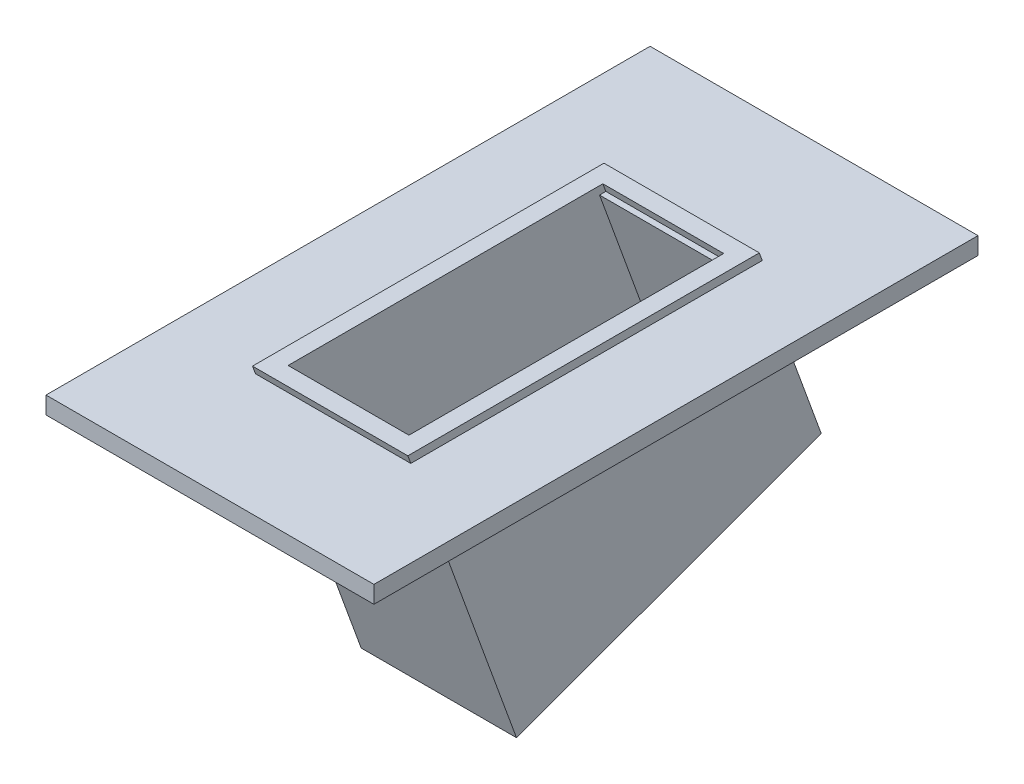
ISO-10303-21;
HEADER;
FILE_DESCRIPTION(('STEP AP214'),'2;1');
FILE_NAME('part.step','',(''),(''),'','','');
FILE_SCHEMA(('AUTOMOTIVE_DESIGN { 1 0 10303 214 1 1 1 1 }'));
ENDSEC;
DATA;
#1=APPLICATION_CONTEXT('core data for automotive mechanical design processes');
#2=APPLICATION_PROTOCOL_DEFINITION('international standard','automotive_design',2000,#1);
#3=PRODUCT_CONTEXT('',#1,'mechanical');
#4=PRODUCT('Part','Part','',(#3));
#5=PRODUCT_RELATED_PRODUCT_CATEGORY('part','',(#4));
#6=PRODUCT_DEFINITION_FORMATION('','',#4);
#7=PRODUCT_DEFINITION_CONTEXT('part definition',#1,'design');
#8=PRODUCT_DEFINITION('design','',#6,#7);
#9=PRODUCT_DEFINITION_SHAPE('','',#8);
#10=(LENGTH_UNIT() NAMED_UNIT(*) SI_UNIT(.MILLI.,.METRE.));
#11=(NAMED_UNIT(*) PLANE_ANGLE_UNIT() SI_UNIT($,.RADIAN.));
#12=(NAMED_UNIT(*) SI_UNIT($,.STERADIAN.) SOLID_ANGLE_UNIT());
#13=UNCERTAINTY_MEASURE_WITH_UNIT(LENGTH_MEASURE(1.E-05),#10,'distance_accuracy_value','');
#14=(GEOMETRIC_REPRESENTATION_CONTEXT(3) GLOBAL_UNCERTAINTY_ASSIGNED_CONTEXT((#13)) GLOBAL_UNIT_ASSIGNED_CONTEXT((#10,
#11,#12)) REPRESENTATION_CONTEXT('',''));
#15=CARTESIAN_POINT('',(0.,0.,0.));
#16=DIRECTION('',(0.,0.,1.));
#17=DIRECTION('',(1.,0.,0.));
#18=AXIS2_PLACEMENT_3D('',#15,#16,#17);
#19=CARTESIAN_POINT('',(18.,0.,0.));
#20=DIRECTION('',(-1.,0.,0.));
#21=DIRECTION('',(0.,0.,1.));
#22=AXIS2_PLACEMENT_3D('',#19,#20,#21);
#23=PLANE('',#22);
#24=DIRECTION('',(0.,0.,1.));
#25=VECTOR('',#24,1.);
#26=CARTESIAN_POINT('',(18.,0.,55.));
#27=LINE('',#26,#25);
#28=CARTESIAN_POINT('',(18.,0.,0.));
#29=VERTEX_POINT('',#28);
#30=CARTESIAN_POINT('',(18.,0.,40.7279404685324));
#31=VERTEX_POINT('',#30);
#32=EDGE_CURVE('E12',#29,#31,#27,.T.);
#33=ORIENTED_EDGE('',*,*,#32,.F.);
#34=DIRECTION('',(0.,0.939692620785908,0.342020143325669));
#35=VECTOR('',#34,1.);
#36=CARTESIAN_POINT('',(18.,0.,0.));
#37=LINE('',#36,#35);
#38=CARTESIAN_POINT('',(18.,0.939692620785908,0.34202014332567));
#39=VERTEX_POINT('',#38);
#40=EDGE_CURVE('E373',#29,#39,#37,.T.);
#41=ORIENTED_EDGE('',*,*,#40,.T.);
#42=DIRECTION('',(0.,0.,1.));
#43=VECTOR('',#42,1.);
#44=CARTESIAN_POINT('',(18.,0.939692620785908,0.34202014332567));
#45=LINE('',#44,#43);
#46=CARTESIAN_POINT('',(18.,0.939692620785908,41.0699606118581));
#47=VERTEX_POINT('',#46);
#48=EDGE_CURVE('E394',#39,#47,#45,.T.);
#49=ORIENTED_EDGE('',*,*,#48,.T.);
#50=DIRECTION('',(0.,0.939692620785908,0.342020143325669));
#51=VECTOR('',#50,1.);
#52=CARTESIAN_POINT('',(18.,0.,40.7279404685324));
#53=LINE('',#52,#51);
#54=EDGE_CURVE('E385',#31,#47,#53,.T.);
#55=ORIENTED_EDGE('',*,*,#54,.F.);
#56=EDGE_LOOP('',(#33,#41,#49,#55));
#57=FACE_BOUND('',#56,.T.);
#58=ADVANCED_FACE('F35',(#57),#23,.F.);
#59=DIRECTION('',(0.,0.,-1.));
#60=VECTOR('',#59,1.);
#61=CARTESIAN_POINT('',(18.,-2.,55.));
#62=LINE('',#61,#60);
#63=CARTESIAN_POINT('',(18.,-2.,40.));
#64=VERTEX_POINT('',#63);
#65=CARTESIAN_POINT('',(18.,-2.,0.));
#66=VERTEX_POINT('',#65);
#67=EDGE_CURVE('E44',#64,#66,#62,.T.);
#68=ORIENTED_EDGE('',*,*,#67,.F.);
#69=DIRECTION('',(0.,-0.939692620785908,-0.34202014332567));
#70=VECTOR('',#69,1.);
#71=CARTESIAN_POINT('',(18.,-14.8557521937308,35.3208888623795));
#72=LINE('',#71,#70);
#73=CARTESIAN_POINT('',(18.,-33.649604609449,28.4804859958661));
#74=VERTEX_POINT('',#73);
#75=EDGE_CURVE('E234',#64,#74,#72,.T.);
#76=ORIENTED_EDGE('',*,*,#75,.T.);
#77=DIRECTION('',(0.,0.342020143325669,-0.939692620785908));
#78=VECTOR('',#77,1.);
#79=CARTESIAN_POINT('',(18.,-33.649604609449,28.4804859958661));
#80=LINE('',#79,#78);
#81=CARTESIAN_POINT('',(18.,-20.7938524157182,-6.84040286651339));
#82=VERTEX_POINT('',#81);
#83=EDGE_CURVE('E232',#74,#82,#80,.T.);
#84=ORIENTED_EDGE('',*,*,#83,.T.);
#85=DIRECTION('',(0.,0.939692620785908,0.342020143325669));
#86=VECTOR('',#85,1.);
#87=CARTESIAN_POINT('',(18.,-2.,0.));
#88=LINE('',#87,#86);
#89=EDGE_CURVE('E229',#82,#66,#88,.T.);
#90=ORIENTED_EDGE('',*,*,#89,.T.);
#91=EDGE_LOOP('',(#68,#76,#84,#90));
#92=FACE_BOUND('',#91,.T.);
#93=ADVANCED_FACE('F440',(#92),#23,.F.);
#94=CARTESIAN_POINT('',(0.,0.,0.));
#95=DIRECTION('',(-1.,0.,0.));
#96=DIRECTION('',(0.,0.,1.));
#97=AXIS2_PLACEMENT_3D('',#94,#95,#96);
#98=PLANE('',#97);
#99=DIRECTION('',(0.,0.,-1.));
#100=VECTOR('',#99,1.);
#101=CARTESIAN_POINT('',(0.,0.,-15.));
#102=LINE('',#101,#100);
#103=CARTESIAN_POINT('',(0.,0.,40.7279404685324));
#104=VERTEX_POINT('',#103);
#105=CARTESIAN_POINT('',(0.,0.,0.));
#106=VERTEX_POINT('',#105);
#107=EDGE_CURVE('E228',#104,#106,#102,.T.);
#108=ORIENTED_EDGE('',*,*,#107,.F.);
#109=DIRECTION('',(0.,0.939692620785908,0.342020143325669));
#110=VECTOR('',#109,1.);
#111=CARTESIAN_POINT('',(0.,0.,40.7279404685324));
#112=LINE('',#111,#110);
#113=CARTESIAN_POINT('',(0.,0.939692620785908,41.0699606118581));
#114=VERTEX_POINT('',#113);
#115=EDGE_CURVE('E404',#104,#114,#112,.T.);
#116=ORIENTED_EDGE('',*,*,#115,.T.);
#117=DIRECTION('',(0.,0.,-1.));
#118=VECTOR('',#117,1.);
#119=CARTESIAN_POINT('',(0.,0.939692620785908,0.342020143325669));
#120=LINE('',#119,#118);
#121=CARTESIAN_POINT('',(0.,0.939692620785908,0.342020143325669));
#122=VERTEX_POINT('',#121);
#123=EDGE_CURVE('E376',#114,#122,#120,.T.);
#124=ORIENTED_EDGE('',*,*,#123,.T.);
#125=DIRECTION('',(0.,0.939692620785908,0.342020143325669));
#126=VECTOR('',#125,1.);
#127=CARTESIAN_POINT('',(0.,0.,0.));
#128=LINE('',#127,#126);
#129=EDGE_CURVE('E382',#106,#122,#128,.T.);
#130=ORIENTED_EDGE('',*,*,#129,.F.);
#131=EDGE_LOOP('',(#108,#116,#124,#130));
#132=FACE_BOUND('',#131,.T.);
#133=ADVANCED_FACE('F438',(#132),#98,.T.);
#134=CARTESIAN_POINT('',(0.,0.939692620785908,0.342020143325669));
#135=DIRECTION('',(0.,1.,0.));
#136=DIRECTION('',(0.,0.,1.));
#137=AXIS2_PLACEMENT_3D('',#134,#135,#136);
#138=PLANE('',#137);
#139=ORIENTED_EDGE('',*,*,#48,.F.);
#140=DIRECTION('',(1.,0.,0.));
#141=VECTOR('',#140,1.);
#142=CARTESIAN_POINT('',(0.,0.939692620785908,0.342020143325669));
#143=LINE('',#142,#141);
#144=EDGE_CURVE('E372',#122,#39,#143,.T.);
#145=ORIENTED_EDGE('',*,*,#144,.F.);
#146=ORIENTED_EDGE('',*,*,#123,.F.);
#147=DIRECTION('',(-1.,0.,0.));
#148=VECTOR('',#147,1.);
#149=CARTESIAN_POINT('',(0.,0.939692620785908,41.0699606118581));
#150=LINE('',#149,#148);
#151=EDGE_CURVE('E389',#47,#114,#150,.T.);
#152=ORIENTED_EDGE('',*,*,#151,.F.);
#153=EDGE_LOOP('',(#139,#145,#146,#152));
#154=FACE_BOUND('',#153,.T.);
#155=DIRECTION('',(1.,0.,0.));
#156=VECTOR('',#155,1.);
#157=CARTESIAN_POINT('',(0.,0.939692620785908,2.47037568827749));
#158=LINE('',#157,#156);
#159=CARTESIAN_POINT('',(2.,0.939692620785908,2.47037568827749));
#160=VERTEX_POINT('',#159);
#161=CARTESIAN_POINT('',(16.,0.939692620785908,2.4703756882775));
#162=VERTEX_POINT('',#161);
#163=EDGE_CURVE('E322',#160,#162,#158,.T.);
#164=ORIENTED_EDGE('',*,*,#163,.T.);
#165=DIRECTION('',(0.,0.,1.));
#166=VECTOR('',#165,1.);
#167=CARTESIAN_POINT('',(16.,0.939692620785908,0.342020143325669));
#168=LINE('',#167,#166);
#169=CARTESIAN_POINT('',(16.,0.939692620785908,38.9416050669062));
#170=VERTEX_POINT('',#169);
#171=EDGE_CURVE('E330',#162,#170,#168,.T.);
#172=ORIENTED_EDGE('',*,*,#171,.T.);
#173=DIRECTION('',(-1.,0.,0.));
#174=VECTOR('',#173,1.);
#175=CARTESIAN_POINT('',(0.,0.939692620785908,38.9416050669062));
#176=LINE('',#175,#174);
#177=CARTESIAN_POINT('',(2.,0.939692620785908,38.9416050669062));
#178=VERTEX_POINT('',#177);
#179=EDGE_CURVE('E364',#170,#178,#176,.T.);
#180=ORIENTED_EDGE('',*,*,#179,.T.);
#181=DIRECTION('',(0.,0.,-1.));
#182=VECTOR('',#181,1.);
#183=CARTESIAN_POINT('',(2.,0.939692620785908,0.));
#184=LINE('',#183,#182);
#185=EDGE_CURVE('E359',#178,#160,#184,.T.);
#186=ORIENTED_EDGE('',*,*,#185,.T.);
#187=EDGE_LOOP('',(#164,#172,#180,#186));
#188=FACE_BOUND('',#187,.T.);
#189=ADVANCED_FACE('F427',(#154,#188),#138,.T.);
#190=CARTESIAN_POINT('',(18.,-2.,55.));
#191=DIRECTION('',(0.,0.,-1.));
#192=DIRECTION('',(-1.,0.,0.));
#193=AXIS2_PLACEMENT_3D('',#190,#191,#192);
#194=PLANE('',#193);
#195=DIRECTION('',(-1.,0.,0.));
#196=VECTOR('',#195,1.);
#197=CARTESIAN_POINT('',(18.,0.,55.));
#198=LINE('',#197,#196);
#199=CARTESIAN_POINT('',(28.,0.,55.));
#200=VERTEX_POINT('',#199);
#201=CARTESIAN_POINT('',(-10.,0.,55.));
#202=VERTEX_POINT('',#201);
#203=EDGE_CURVE('E196',#200,#202,#198,.T.);
#204=ORIENTED_EDGE('',*,*,#203,.T.);
#205=DIRECTION('',(0.,1.,0.));
#206=VECTOR('',#205,1.);
#207=CARTESIAN_POINT('',(-10.,0.,55.));
#208=LINE('',#207,#206);
#209=CARTESIAN_POINT('',(-10.,-2.,55.));
#210=VERTEX_POINT('',#209);
#211=EDGE_CURVE('E192',#210,#202,#208,.T.);
#212=ORIENTED_EDGE('',*,*,#211,.F.);
#213=DIRECTION('',(-1.,0.,0.));
#214=VECTOR('',#213,1.);
#215=CARTESIAN_POINT('',(18.,-2.,55.));
#216=LINE('',#215,#214);
#217=CARTESIAN_POINT('',(28.,-2.,55.));
#218=VERTEX_POINT('',#217);
#219=EDGE_CURVE('E187',#218,#210,#216,.T.);
#220=ORIENTED_EDGE('',*,*,#219,.F.);
#221=DIRECTION('',(0.,-1.,0.));
#222=VECTOR('',#221,1.);
#223=CARTESIAN_POINT('',(28.,-2.,55.));
#224=LINE('',#223,#222);
#225=EDGE_CURVE('E190',#200,#218,#224,.T.);
#226=ORIENTED_EDGE('',*,*,#225,.F.);
#227=EDGE_LOOP('',(#204,#212,#220,#226));
#228=FACE_BOUND('',#227,.T.);
#229=ADVANCED_FACE('F37',(#228),#194,.F.);
#230=CARTESIAN_POINT('',(18.,-14.8557521937308,35.3208888623795));
#231=DIRECTION('',(0.,0.34202014332567,-0.939692620785908));
#232=DIRECTION('',(0.,0.939692620785908,0.34202014332567));
#233=AXIS2_PLACEMENT_3D('',#230,#231,#232);
#234=PLANE('',#233);
#235=DIRECTION('',(0.,-0.939692620785908,-0.34202014332567));
#236=VECTOR('',#235,1.);
#237=CARTESIAN_POINT('',(0.,-14.8557521937308,35.3208888623795));
#238=LINE('',#237,#236);
#239=CARTESIAN_POINT('',(0.,-2.,40.));
#240=VERTEX_POINT('',#239);
#241=CARTESIAN_POINT('',(0.,-33.649604609449,28.4804859958661));
#242=VERTEX_POINT('',#241);
#243=EDGE_CURVE('E248',#240,#242,#238,.T.);
#244=ORIENTED_EDGE('',*,*,#243,.T.);
#245=DIRECTION('',(-1.,0.,0.));
#246=VECTOR('',#245,1.);
#247=CARTESIAN_POINT('',(18.,-33.649604609449,28.4804859958661));
#248=LINE('',#247,#246);
#249=EDGE_CURVE('E258',#74,#242,#248,.T.);
#250=ORIENTED_EDGE('',*,*,#249,.F.);
#251=ORIENTED_EDGE('',*,*,#75,.F.);
#252=DIRECTION('',(-1.,0.,0.));
#253=VECTOR('',#252,1.);
#254=CARTESIAN_POINT('',(18.,-2.,40.));
#255=LINE('',#254,#253);
#256=EDGE_CURVE('E197',#64,#240,#255,.T.);
#257=ORIENTED_EDGE('',*,*,#256,.T.);
#258=EDGE_LOOP('',(#244,#250,#251,#257));
#259=FACE_BOUND('',#258,.T.);
#260=ADVANCED_FACE('F635',(#259),#234,.F.);
#261=CARTESIAN_POINT('',(18.,-33.649604609449,28.4804859958661));
#262=DIRECTION('',(0.,0.939692620785908,0.342020143325669));
#263=DIRECTION('',(0.,-0.342020143325669,0.939692620785908));
#264=AXIS2_PLACEMENT_3D('',#261,#262,#263);
#265=PLANE('',#264);
#266=CARTESIAN_POINT('',(6.49999999999999,-22.5018505346893,-2.14771660216916));
#267=DIRECTION('',(0.,-0.939692620785908,-0.342020143325669));
#268=DIRECTION('',(0.,-0.342020143325669,0.939692620785908));
#269=AXIS2_PLACEMENT_3D('',#266,#267,#268);
#270=CIRCLE('',#269,1.);
#271=CARTESIAN_POINT('',(6.49999999999999,-22.843870678015,-1.20802398138325));
#272=VERTEX_POINT('',#271);
#273=EDGE_CURVE('E292',#272,#272,#270,.T.);
#274=ORIENTED_EDGE('',*,*,#273,.F.);
#275=EDGE_LOOP('',(#274));
#276=FACE_BOUND('',#275,.T.);
#277=CARTESIAN_POINT('',(11.5,-22.5018505346893,-2.14771660216916));
#278=DIRECTION('',(0.,-0.939692620785908,-0.342020143325669));
#279=DIRECTION('',(0.,0.342020143325669,-0.939692620785908));
#280=AXIS2_PLACEMENT_3D('',#277,#278,#279);
#281=CIRCLE('',#280,0.999999999999998);
#282=CARTESIAN_POINT('',(11.5,-22.1598303913637,-3.08740922295507));
#283=VERTEX_POINT('',#282);
#284=EDGE_CURVE('E288',#283,#283,#281,.T.);
#285=ORIENTED_EDGE('',*,*,#284,.F.);
#286=EDGE_LOOP('',(#285));
#287=FACE_BOUND('',#286,.T.);
#288=CARTESIAN_POINT('',(11.5,-31.9416064904778,23.7877997315219));
#289=DIRECTION('',(0.,-0.939692620785908,-0.342020143325669));
#290=DIRECTION('',(0.,-0.342020143325669,0.939692620785908));
#291=AXIS2_PLACEMENT_3D('',#288,#289,#290);
#292=CIRCLE('',#291,0.999999999999999);
#293=CARTESIAN_POINT('',(11.5,-32.2836266338035,24.7274923523078));
#294=VERTEX_POINT('',#293);
#295=EDGE_CURVE('E284',#294,#294,#292,.T.);
#296=ORIENTED_EDGE('',*,*,#295,.F.);
#297=EDGE_LOOP('',(#296));
#298=FACE_BOUND('',#297,.T.);
#299=CARTESIAN_POINT('',(6.49999999999999,-31.9416064904778,23.7877997315219));
#300=DIRECTION('',(0.,-0.939692620785908,-0.342020143325669));
#301=DIRECTION('',(0.,0.342020143325669,-0.939692620785908));
#302=AXIS2_PLACEMENT_3D('',#299,#300,#301);
#303=CIRCLE('',#302,1.);
#304=CARTESIAN_POINT('',(6.49999999999999,-31.5995863471522,22.848107110736));
#305=VERTEX_POINT('',#304);
#306=EDGE_CURVE('E280',#305,#305,#303,.T.);
#307=ORIENTED_EDGE('',*,*,#306,.F.);
#308=EDGE_LOOP('',(#307));
#309=FACE_BOUND('',#308,.T.);
#310=DIRECTION('',(1.,0.,0.));
#311=VECTOR('',#310,1.);
#312=CARTESIAN_POINT('',(3.5,-23.2884968643384,0.0135764256384303));
#313=LINE('',#312,#311);
#314=CARTESIAN_POINT('',(3.5,-23.2884968643384,0.0135764256384355));
#315=VERTEX_POINT('',#314);
#316=CARTESIAN_POINT('',(14.5,-23.2884968643384,0.0135764256384303));
#317=VERTEX_POINT('',#316);
#318=EDGE_CURVE('E311',#315,#317,#313,.T.);
#319=ORIENTED_EDGE('',*,*,#318,.F.);
#320=DIRECTION('',(0.,0.342020143325669,-0.939692620785908));
#321=VECTOR('',#320,1.);
#322=CARTESIAN_POINT('',(3.5,-31.1549601608288,21.6265067037143));
#323=LINE('',#322,#321);
#324=CARTESIAN_POINT('',(3.5,-31.1549601608288,21.6265067037143));
#325=VERTEX_POINT('',#324);
#326=EDGE_CURVE('E52',#325,#315,#323,.T.);
#327=ORIENTED_EDGE('',*,*,#326,.F.);
#328=DIRECTION('',(-1.,0.,0.));
#329=VECTOR('',#328,1.);
#330=CARTESIAN_POINT('',(3.5,-31.1549601608288,21.6265067037143));
#331=LINE('',#330,#329);
#332=CARTESIAN_POINT('',(14.5,-31.1549601608288,21.6265067037143));
#333=VERTEX_POINT('',#332);
#334=EDGE_CURVE('E316',#333,#325,#331,.T.);
#335=ORIENTED_EDGE('',*,*,#334,.F.);
#336=DIRECTION('',(0.,-0.342020143325669,0.939692620785908));
#337=VECTOR('',#336,1.);
#338=CARTESIAN_POINT('',(14.5,-31.1549601608288,21.6265067037143));
#339=LINE('',#338,#337);
#340=EDGE_CURVE('E313',#317,#333,#339,.T.);
#341=ORIENTED_EDGE('',*,*,#340,.F.);
#342=EDGE_LOOP('',(#319,#327,#335,#341));
#343=FACE_BOUND('',#342,.T.);
#344=DIRECTION('',(0.,0.342020143325669,-0.939692620785908));
#345=VECTOR('',#344,1.);
#346=CARTESIAN_POINT('',(0.,-33.649604609449,28.4804859958661));
#347=LINE('',#346,#345);
#348=CARTESIAN_POINT('',(0.,-20.7938524157182,-6.84040286651339));
#349=VERTEX_POINT('',#348);
#350=EDGE_CURVE('E241',#242,#349,#347,.T.);
#351=ORIENTED_EDGE('',*,*,#350,.T.);
#352=DIRECTION('',(-1.,0.,0.));
#353=VECTOR('',#352,1.);
#354=CARTESIAN_POINT('',(18.,-20.7938524157182,-6.84040286651339));
#355=LINE('',#354,#353);
#356=EDGE_CURVE('E256',#82,#349,#355,.T.);
#357=ORIENTED_EDGE('',*,*,#356,.F.);
#358=ORIENTED_EDGE('',*,*,#83,.F.);
#359=ORIENTED_EDGE('',*,*,#249,.T.);
#360=EDGE_LOOP('',(#351,#357,#358,#359));
#361=FACE_BOUND('',#360,.T.);
#362=ADVANCED_FACE('F628',(#276,#287,#298,#309,#343,#361),#265,.F.);
#363=CARTESIAN_POINT('',(18.,-2.,0.));
#364=DIRECTION('',(0.,-0.342020143325669,0.939692620785908));
#365=DIRECTION('',(0.,-0.939692620785908,-0.342020143325669));
#366=AXIS2_PLACEMENT_3D('',#363,#364,#365);
#367=PLANE('',#366);
#368=DIRECTION('',(0.,0.939692620785908,0.342020143325669));
#369=VECTOR('',#368,1.);
#370=CARTESIAN_POINT('',(0.,-2.,0.));
#371=LINE('',#370,#369);
#372=CARTESIAN_POINT('',(0.,-2.,0.));
#373=VERTEX_POINT('',#372);
#374=EDGE_CURVE('E235',#349,#373,#371,.T.);
#375=ORIENTED_EDGE('',*,*,#374,.T.);
#376=DIRECTION('',(-1.,0.,0.));
#377=VECTOR('',#376,1.);
#378=CARTESIAN_POINT('',(18.,-2.,0.));
#379=LINE('',#378,#377);
#380=EDGE_CURVE('E255',#66,#373,#379,.T.);
#381=ORIENTED_EDGE('',*,*,#380,.F.);
#382=ORIENTED_EDGE('',*,*,#89,.F.);
#383=ORIENTED_EDGE('',*,*,#356,.T.);
#384=EDGE_LOOP('',(#375,#381,#382,#383));
#385=FACE_BOUND('',#384,.T.);
#386=ADVANCED_FACE('F621',(#385),#367,.F.);
#387=CARTESIAN_POINT('',(18.,-2.,0.));
#388=DIRECTION('',(0.,1.,0.));
#389=DIRECTION('',(0.,0.,1.));
#390=AXIS2_PLACEMENT_3D('',#387,#388,#389);
#391=PLANE('',#390);
#392=ORIENTED_EDGE('',*,*,#256,.F.);
#393=ORIENTED_EDGE('',*,*,#67,.T.);
#394=ORIENTED_EDGE('',*,*,#380,.T.);
#395=DIRECTION('',(0.,0.,1.));
#396=VECTOR('',#395,1.);
#397=CARTESIAN_POINT('',(0.,-2.,-15.));
#398=LINE('',#397,#396);
#399=EDGE_CURVE('E276',#373,#240,#398,.T.);
#400=ORIENTED_EDGE('',*,*,#399,.T.);
#401=EDGE_LOOP('',(#392,#393,#394,#400));
#402=FACE_BOUND('',#401,.T.);
#403=DIRECTION('',(0.,0.,-1.));
#404=VECTOR('',#403,1.);
#405=CARTESIAN_POINT('',(28.,-2.,55.));
#406=LINE('',#405,#404);
#407=CARTESIAN_POINT('',(28.,-2.,-15.));
#408=VERTEX_POINT('',#407);
#409=EDGE_CURVE('E200',#218,#408,#406,.T.);
#410=ORIENTED_EDGE('',*,*,#409,.F.);
#411=ORIENTED_EDGE('',*,*,#219,.T.);
#412=DIRECTION('',(0.,0.,1.));
#413=VECTOR('',#412,1.);
#414=CARTESIAN_POINT('',(-10.,-2.,-15.));
#415=LINE('',#414,#413);
#416=CARTESIAN_POINT('',(-10.,-2.,-15.));
#417=VERTEX_POINT('',#416);
#418=EDGE_CURVE('E863',#417,#210,#415,.T.);
#419=ORIENTED_EDGE('',*,*,#418,.F.);
#420=DIRECTION('',(-1.,0.,0.));
#421=VECTOR('',#420,1.);
#422=CARTESIAN_POINT('',(18.,-2.,-15.));
#423=LINE('',#422,#421);
#424=EDGE_CURVE('E202',#408,#417,#423,.T.);
#425=ORIENTED_EDGE('',*,*,#424,.F.);
#426=EDGE_LOOP('',(#410,#411,#419,#425));
#427=FACE_BOUND('',#426,.T.);
#428=ADVANCED_FACE('F201',(#402,#427),#391,.F.);
#429=CARTESIAN_POINT('',(18.,0.,-15.));
#430=DIRECTION('',(0.,0.,1.));
#431=DIRECTION('',(1.,0.,0.));
#432=AXIS2_PLACEMENT_3D('',#429,#430,#431);
#433=PLANE('',#432);
#434=ORIENTED_EDGE('',*,*,#424,.T.);
#435=DIRECTION('',(0.,-1.,0.));
#436=VECTOR('',#435,1.);
#437=CARTESIAN_POINT('',(-10.,0.,-15.));
#438=LINE('',#437,#436);
#439=CARTESIAN_POINT('',(-10.,0.,-15.));
#440=VERTEX_POINT('',#439);
#441=EDGE_CURVE('E216',#440,#417,#438,.T.);
#442=ORIENTED_EDGE('',*,*,#441,.F.);
#443=DIRECTION('',(-1.,0.,0.));
#444=VECTOR('',#443,1.);
#445=CARTESIAN_POINT('',(18.,0.,-15.));
#446=LINE('',#445,#444);
#447=CARTESIAN_POINT('',(28.,0.,-15.));
#448=VERTEX_POINT('',#447);
#449=EDGE_CURVE('E231',#448,#440,#446,.T.);
#450=ORIENTED_EDGE('',*,*,#449,.F.);
#451=DIRECTION('',(0.,1.,0.));
#452=VECTOR('',#451,1.);
#453=CARTESIAN_POINT('',(28.,-2.,-15.));
#454=LINE('',#453,#452);
#455=EDGE_CURVE('E206',#408,#448,#454,.T.);
#456=ORIENTED_EDGE('',*,*,#455,.F.);
#457=EDGE_LOOP('',(#434,#442,#450,#456));
#458=FACE_BOUND('',#457,.T.);
#459=ADVANCED_FACE('F609',(#458),#433,.F.);
#460=CARTESIAN_POINT('',(18.,0.,40.));
#461=DIRECTION('',(0.,-1.,0.));
#462=DIRECTION('',(0.,0.,-1.));
#463=AXIS2_PLACEMENT_3D('',#460,#461,#462);
#464=PLANE('',#463);
#465=DIRECTION('',(1.,0.,0.));
#466=VECTOR('',#465,1.);
#467=CARTESIAN_POINT('',(0.,0.,0.));
#468=LINE('',#467,#466);
#469=EDGE_CURVE('E377',#106,#29,#468,.T.);
#470=ORIENTED_EDGE('',*,*,#469,.T.);
#471=ORIENTED_EDGE('',*,*,#32,.T.);
#472=DIRECTION('',(-1.,0.,0.));
#473=VECTOR('',#472,1.);
#474=CARTESIAN_POINT('',(0.,0.,40.7279404685324));
#475=LINE('',#474,#473);
#476=EDGE_CURVE('E388',#31,#104,#475,.T.);
#477=ORIENTED_EDGE('',*,*,#476,.T.);
#478=ORIENTED_EDGE('',*,*,#107,.T.);
#479=EDGE_LOOP('',(#470,#471,#477,#478));
#480=FACE_BOUND('',#479,.T.);
#481=ORIENTED_EDGE('',*,*,#449,.T.);
#482=DIRECTION('',(0.,0.,-1.));
#483=VECTOR('',#482,1.);
#484=CARTESIAN_POINT('',(-10.,0.,-15.));
#485=LINE('',#484,#483);
#486=EDGE_CURVE('E300',#202,#440,#485,.T.);
#487=ORIENTED_EDGE('',*,*,#486,.F.);
#488=ORIENTED_EDGE('',*,*,#203,.F.);
#489=DIRECTION('',(0.,0.,1.));
#490=VECTOR('',#489,1.);
#491=CARTESIAN_POINT('',(28.,0.,55.));
#492=LINE('',#491,#490);
#493=EDGE_CURVE('E211',#448,#200,#492,.T.);
#494=ORIENTED_EDGE('',*,*,#493,.F.);
#495=EDGE_LOOP('',(#481,#487,#488,#494));
#496=FACE_BOUND('',#495,.T.);
#497=ADVANCED_FACE('F436',(#480,#496),#464,.F.);
#498=ORIENTED_EDGE('',*,*,#399,.F.);
#499=ORIENTED_EDGE('',*,*,#374,.F.);
#500=ORIENTED_EDGE('',*,*,#350,.F.);
#501=ORIENTED_EDGE('',*,*,#243,.F.);
#502=EDGE_LOOP('',(#498,#499,#500,#501));
#503=FACE_BOUND('',#502,.T.);
#504=ADVANCED_FACE('F442',(#503),#98,.T.);
#505=CARTESIAN_POINT('',(0.,0.,0.));
#506=DIRECTION('',(0.,-0.342020143325669,0.939692620785908));
#507=DIRECTION('',(0.,-0.939692620785908,-0.342020143325669));
#508=AXIS2_PLACEMENT_3D('',#505,#506,#507);
#509=PLANE('',#508);
#510=ORIENTED_EDGE('',*,*,#144,.T.);
#511=ORIENTED_EDGE('',*,*,#40,.F.);
#512=ORIENTED_EDGE('',*,*,#469,.F.);
#513=ORIENTED_EDGE('',*,*,#129,.T.);
#514=EDGE_LOOP('',(#510,#511,#512,#513));
#515=FACE_BOUND('',#514,.T.);
#516=ADVANCED_FACE('F421',(#515),#509,.F.);
#517=CARTESIAN_POINT('',(0.,0.,40.7279404685324));
#518=DIRECTION('',(0.,0.342020143325669,-0.939692620785908));
#519=DIRECTION('',(0.,0.939692620785908,0.342020143325669));
#520=AXIS2_PLACEMENT_3D('',#517,#518,#519);
#521=PLANE('',#520);
#522=ORIENTED_EDGE('',*,*,#151,.T.);
#523=ORIENTED_EDGE('',*,*,#115,.F.);
#524=ORIENTED_EDGE('',*,*,#476,.F.);
#525=ORIENTED_EDGE('',*,*,#54,.T.);
#526=EDGE_LOOP('',(#522,#523,#524,#525));
#527=FACE_BOUND('',#526,.T.);
#528=ADVANCED_FACE('F433',(#527),#521,.F.);
#529=CARTESIAN_POINT('',(18.,-14.1717119070795,33.4415036208077));
#530=DIRECTION('',(0.,0.34202014332567,-0.939692620785908));
#531=DIRECTION('',(0.,0.939692620785908,0.34202014332567));
#532=AXIS2_PLACEMENT_3D('',#529,#530,#531);
#533=PLANE('',#532);
#534=DIRECTION('',(-1.,0.,0.));
#535=VECTOR('',#534,1.);
#536=CARTESIAN_POINT('',(18.,-31.0861790812258,27.2851410409457));
#537=LINE('',#536,#535);
#538=CARTESIAN_POINT('',(16.,-31.0861790812258,27.2851410409457));
#539=VERTEX_POINT('',#538);
#540=CARTESIAN_POINT('',(2.,-31.0861790812258,27.2851410409457));
#541=VERTEX_POINT('',#540);
#542=EDGE_CURVE('E331',#539,#541,#537,.T.);
#543=ORIENTED_EDGE('',*,*,#542,.T.);
#544=DIRECTION('',(0.,-0.939692620785908,-0.34202014332567));
#545=VECTOR('',#544,1.);
#546=CARTESIAN_POINT('',(2.,-12.4056674639605,34.0842912304943));
#547=LINE('',#546,#545);
#548=EDGE_CURVE('E327',#178,#541,#547,.T.);
#549=ORIENTED_EDGE('',*,*,#548,.F.);
#550=ORIENTED_EDGE('',*,*,#179,.F.);
#551=DIRECTION('',(0.,-0.939692620785908,-0.34202014332567));
#552=VECTOR('',#551,1.);
#553=CARTESIAN_POINT('',(16.,-12.4056674639605,34.0842912304943));
#554=LINE('',#553,#552);
#555=EDGE_CURVE('E336',#170,#539,#554,.T.);
#556=ORIENTED_EDGE('',*,*,#555,.T.);
#557=EDGE_LOOP('',(#543,#549,#550,#556));
#558=FACE_BOUND('',#557,.T.);
#559=ADVANCED_FACE('F458',(#558),#533,.T.);
#560=CARTESIAN_POINT('',(18.,-31.7702193678772,29.1645262825175));
#561=DIRECTION('',(0.,0.939692620785908,0.342020143325669));
#562=DIRECTION('',(0.,-0.342020143325669,0.939692620785908));
#563=AXIS2_PLACEMENT_3D('',#560,#561,#562);
#564=PLANE('',#563);
#565=CARTESIAN_POINT('',(6.49999999999999,-20.6224652931175,-1.46367631551782));
#566=DIRECTION('',(0.,0.939692620785908,0.342020143325669));
#567=DIRECTION('',(0.,-0.342020143325669,0.939692620785908));
#568=AXIS2_PLACEMENT_3D('',#565,#566,#567);
#569=CIRCLE('',#568,1.);
#570=CARTESIAN_POINT('',(6.49999999999999,-20.9644854364432,-0.52398369473191));
#571=VERTEX_POINT('',#570);
#572=EDGE_CURVE('E289',#571,#571,#569,.T.);
#573=ORIENTED_EDGE('',*,*,#572,.F.);
#574=EDGE_LOOP('',(#573));
#575=FACE_BOUND('',#574,.T.);
#576=CARTESIAN_POINT('',(11.5,-20.6224652931175,-1.46367631551782));
#577=DIRECTION('',(0.,0.939692620785908,0.342020143325669));
#578=DIRECTION('',(0.,-0.342020143325669,0.939692620785908));
#579=AXIS2_PLACEMENT_3D('',#576,#577,#578);
#580=CIRCLE('',#579,0.999999999999998);
#581=CARTESIAN_POINT('',(11.5,-20.9644854364432,-0.523983694731911));
#582=VERTEX_POINT('',#581);
#583=EDGE_CURVE('E285',#582,#582,#580,.T.);
#584=ORIENTED_EDGE('',*,*,#583,.F.);
#585=EDGE_LOOP('',(#584));
#586=FACE_BOUND('',#585,.T.);
#587=CARTESIAN_POINT('',(11.5,-30.062221248906,24.4718400181733));
#588=DIRECTION('',(0.,0.939692620785908,0.342020143325669));
#589=DIRECTION('',(0.,-0.342020143325669,0.939692620785908));
#590=AXIS2_PLACEMENT_3D('',#587,#588,#589);
#591=CIRCLE('',#590,0.999999999999999);
#592=CARTESIAN_POINT('',(11.5,-30.4042413922317,25.4115326389592));
#593=VERTEX_POINT('',#592);
#594=EDGE_CURVE('E281',#593,#593,#591,.T.);
#595=ORIENTED_EDGE('',*,*,#594,.F.);
#596=EDGE_LOOP('',(#595));
#597=FACE_BOUND('',#596,.T.);
#598=CARTESIAN_POINT('',(6.49999999999999,-30.062221248906,24.4718400181733));
#599=DIRECTION('',(0.,0.939692620785908,0.342020143325669));
#600=DIRECTION('',(0.,-0.342020143325669,0.939692620785908));
#601=AXIS2_PLACEMENT_3D('',#598,#599,#600);
#602=CIRCLE('',#601,1.);
#603=CARTESIAN_POINT('',(6.49999999999999,-30.4042413922317,25.4115326389592));
#604=VERTEX_POINT('',#603);
#605=EDGE_CURVE('E277',#604,#604,#602,.T.);
#606=ORIENTED_EDGE('',*,*,#605,.F.);
#607=EDGE_LOOP('',(#606));
#608=FACE_BOUND('',#607,.T.);
#609=DIRECTION('',(0.,-0.342020143325669,0.939692620785908));
#610=VECTOR('',#609,1.);
#611=CARTESIAN_POINT('',(3.5,-31.7702193678772,29.1645262825175));
#612=LINE('',#611,#610);
#613=CARTESIAN_POINT('',(3.5,-21.4091116227666,0.697616712289772));
#614=VERTEX_POINT('',#613);
#615=CARTESIAN_POINT('',(3.5,-29.275574919257,22.3105469903657));
#616=VERTEX_POINT('',#615);
#617=EDGE_CURVE('E274',#614,#616,#612,.T.);
#618=ORIENTED_EDGE('',*,*,#617,.F.);
#619=DIRECTION('',(-1.,0.,0.));
#620=VECTOR('',#619,1.);
#621=CARTESIAN_POINT('',(18.,-21.4091116227666,0.697616712289774));
#622=LINE('',#621,#620);
#623=CARTESIAN_POINT('',(14.5,-21.4091116227666,0.697616712289774));
#624=VERTEX_POINT('',#623);
#625=EDGE_CURVE('E268',#624,#614,#622,.T.);
#626=ORIENTED_EDGE('',*,*,#625,.F.);
#627=DIRECTION('',(0.,0.342020143325669,-0.939692620785908));
#628=VECTOR('',#627,1.);
#629=CARTESIAN_POINT('',(14.5,-31.7702193678772,29.1645262825175));
#630=LINE('',#629,#628);
#631=CARTESIAN_POINT('',(14.5,-29.275574919257,22.3105469903657));
#632=VERTEX_POINT('',#631);
#633=EDGE_CURVE('E270',#632,#624,#630,.T.);
#634=ORIENTED_EDGE('',*,*,#633,.F.);
#635=DIRECTION('',(1.,0.,0.));
#636=VECTOR('',#635,1.);
#637=CARTESIAN_POINT('',(18.,-29.275574919257,22.3105469903657));
#638=LINE('',#637,#636);
#639=EDGE_CURVE('E272',#616,#632,#638,.T.);
#640=ORIENTED_EDGE('',*,*,#639,.F.);
#641=EDGE_LOOP('',(#618,#626,#634,#640));
#642=FACE_BOUND('',#641,.T.);
#643=DIRECTION('',(0.,0.342020143325669,-0.939692620785908));
#644=VECTOR('',#643,1.);
#645=CARTESIAN_POINT('',(2.,-18.6805116172653,-6.79915018954859));
#646=LINE('',#645,#644);
#647=CARTESIAN_POINT('',(2.,-19.5985074607977,-4.27697733829024));
#648=VERTEX_POINT('',#647);
#649=EDGE_CURVE('E329',#541,#648,#646,.T.);
#650=ORIENTED_EDGE('',*,*,#649,.F.);
#651=ORIENTED_EDGE('',*,*,#542,.F.);
#652=DIRECTION('',(0.,0.342020143325669,-0.939692620785908));
#653=VECTOR('',#652,1.);
#654=CARTESIAN_POINT('',(16.,-18.6805116172653,-6.79915018954859));
#655=LINE('',#654,#653);
#656=CARTESIAN_POINT('',(16.,-19.5985074607977,-4.27697733829024));
#657=VERTEX_POINT('',#656);
#658=EDGE_CURVE('E338',#539,#657,#655,.T.);
#659=ORIENTED_EDGE('',*,*,#658,.T.);
#660=DIRECTION('',(-1.,0.,0.));
#661=VECTOR('',#660,1.);
#662=CARTESIAN_POINT('',(18.,-19.5985074607977,-4.27697733829024));
#663=LINE('',#662,#661);
#664=EDGE_CURVE('E335',#657,#648,#663,.T.);
#665=ORIENTED_EDGE('',*,*,#664,.T.);
#666=EDGE_LOOP('',(#650,#651,#659,#665));
#667=FACE_BOUND('',#666,.T.);
#668=ADVANCED_FACE('F481',(#575,#586,#597,#608,#642,#667),#564,.T.);
#669=CARTESIAN_POINT('',(18.,-2.68404028665134,1.87938524157182));
#670=DIRECTION('',(0.,-0.342020143325669,0.939692620785908));
#671=DIRECTION('',(0.,-0.939692620785908,-0.342020143325669));
#672=AXIS2_PLACEMENT_3D('',#669,#670,#671);
#673=PLANE('',#672);
#674=DIRECTION('',(0.,0.939692620785908,0.342020143325669));
#675=VECTOR('',#674,1.);
#676=CARTESIAN_POINT('',(2.,-0.917995843532362,2.52217285125836));
#677=LINE('',#676,#675);
#678=CARTESIAN_POINT('',(2.,0.,2.85629601348423));
#679=VERTEX_POINT('',#678);
#680=EDGE_CURVE('E341',#648,#679,#677,.T.);
#681=ORIENTED_EDGE('',*,*,#680,.F.);
#682=ORIENTED_EDGE('',*,*,#664,.F.);
#683=DIRECTION('',(0.,0.939692620785908,0.342020143325669));
#684=VECTOR('',#683,1.);
#685=CARTESIAN_POINT('',(16.,-0.917995843532362,2.52217285125836));
#686=LINE('',#685,#684);
#687=CARTESIAN_POINT('',(16.,0.,2.85629601348423));
#688=VERTEX_POINT('',#687);
#689=EDGE_CURVE('E346',#657,#688,#686,.T.);
#690=ORIENTED_EDGE('',*,*,#689,.T.);
#691=DIRECTION('',(-1.,0.,0.));
#692=VECTOR('',#691,1.);
#693=CARTESIAN_POINT('',(18.,0.,2.85629601348423));
#694=LINE('',#693,#692);
#695=EDGE_CURVE('E344',#688,#679,#694,.T.);
#696=ORIENTED_EDGE('',*,*,#695,.T.);
#697=EDGE_LOOP('',(#681,#682,#690,#696));
#698=FACE_BOUND('',#697,.T.);
#699=ADVANCED_FACE('F477',(#698),#673,.T.);
#700=CARTESIAN_POINT('',(18.,0.,0.));
#701=DIRECTION('',(0.,1.,0.));
#702=DIRECTION('',(0.,0.,1.));
#703=AXIS2_PLACEMENT_3D('',#700,#701,#702);
#704=PLANE('',#703);
#705=DIRECTION('',(0.,0.,-1.));
#706=VECTOR('',#705,1.);
#707=CARTESIAN_POINT('',(2.,0.,0.));
#708=LINE('',#707,#706);
#709=CARTESIAN_POINT('',(2.,0.,2.12835554495182));
#710=VERTEX_POINT('',#709);
#711=EDGE_CURVE('E339',#679,#710,#708,.T.);
#712=ORIENTED_EDGE('',*,*,#711,.F.);
#713=ORIENTED_EDGE('',*,*,#695,.F.);
#714=DIRECTION('',(0.,0.,-1.));
#715=VECTOR('',#714,1.);
#716=CARTESIAN_POINT('',(16.,0.,0.));
#717=LINE('',#716,#715);
#718=CARTESIAN_POINT('',(16.,0.,2.12835554495183));
#719=VERTEX_POINT('',#718);
#720=EDGE_CURVE('E351',#688,#719,#717,.T.);
#721=ORIENTED_EDGE('',*,*,#720,.T.);
#722=DIRECTION('',(1.,0.,0.));
#723=VECTOR('',#722,1.);
#724=CARTESIAN_POINT('',(18.,0.,2.12835554495183));
#725=LINE('',#724,#723);
#726=EDGE_CURVE('E334',#710,#719,#725,.T.);
#727=ORIENTED_EDGE('',*,*,#726,.F.);
#728=EDGE_LOOP('',(#712,#713,#721,#727));
#729=FACE_BOUND('',#728,.T.);
#730=ADVANCED_FACE('F473',(#729),#704,.T.);
#731=CARTESIAN_POINT('',(16.,0.,0.));
#732=DIRECTION('',(-1.,0.,0.));
#733=DIRECTION('',(0.,0.,1.));
#734=AXIS2_PLACEMENT_3D('',#731,#732,#733);
#735=PLANE('',#734);
#736=ORIENTED_EDGE('',*,*,#720,.F.);
#737=ORIENTED_EDGE('',*,*,#689,.F.);
#738=ORIENTED_EDGE('',*,*,#658,.F.);
#739=ORIENTED_EDGE('',*,*,#555,.F.);
#740=ORIENTED_EDGE('',*,*,#171,.F.);
#741=DIRECTION('',(0.,0.939692620785908,0.342020143325669));
#742=VECTOR('',#741,1.);
#743=CARTESIAN_POINT('',(16.,-0.684040286651339,1.87938524157182));
#744=LINE('',#743,#742);
#745=EDGE_CURVE('E357',#719,#162,#744,.T.);
#746=ORIENTED_EDGE('',*,*,#745,.F.);
#747=EDGE_LOOP('',(#736,#737,#738,#739,#740,#746));
#748=FACE_BOUND('',#747,.T.);
#749=ADVANCED_FACE('F469',(#748),#735,.T.);
#750=CARTESIAN_POINT('',(2.,0.,0.));
#751=DIRECTION('',(-1.,0.,0.));
#752=DIRECTION('',(0.,0.,1.));
#753=AXIS2_PLACEMENT_3D('',#750,#751,#752);
#754=PLANE('',#753);
#755=ORIENTED_EDGE('',*,*,#548,.T.);
#756=ORIENTED_EDGE('',*,*,#649,.T.);
#757=ORIENTED_EDGE('',*,*,#680,.T.);
#758=ORIENTED_EDGE('',*,*,#711,.T.);
#759=DIRECTION('',(0.,0.939692620785908,0.342020143325669));
#760=VECTOR('',#759,1.);
#761=CARTESIAN_POINT('',(2.,-0.684040286651339,1.87938524157182));
#762=LINE('',#761,#760);
#763=EDGE_CURVE('E360',#710,#160,#762,.T.);
#764=ORIENTED_EDGE('',*,*,#763,.T.);
#765=ORIENTED_EDGE('',*,*,#185,.F.);
#766=EDGE_LOOP('',(#755,#756,#757,#758,#764,#765));
#767=FACE_BOUND('',#766,.T.);
#768=ADVANCED_FACE('F465',(#767),#754,.F.);
#769=CARTESIAN_POINT('',(0.,-0.684040286651339,1.87938524157182));
#770=DIRECTION('',(0.,-0.342020143325669,0.939692620785908));
#771=DIRECTION('',(0.,-0.939692620785908,-0.342020143325669));
#772=AXIS2_PLACEMENT_3D('',#769,#770,#771);
#773=PLANE('',#772);
#774=ORIENTED_EDGE('',*,*,#726,.T.);
#775=ORIENTED_EDGE('',*,*,#745,.T.);
#776=ORIENTED_EDGE('',*,*,#163,.F.);
#777=ORIENTED_EDGE('',*,*,#763,.F.);
#778=EDGE_LOOP('',(#774,#775,#776,#777));
#779=FACE_BOUND('',#778,.T.);
#780=ADVANCED_FACE('F461',(#779),#773,.T.);
#781=CARTESIAN_POINT('',(3.5,7.91146448467004,35.8455224338795));
#782=DIRECTION('',(-1.,0.,0.));
#783=DIRECTION('',(0.,0.,1.));
#784=AXIS2_PLACEMENT_3D('',#781,#782,#783);
#785=PLANE('',#784);
#786=ORIENTED_EDGE('',*,*,#617,.T.);
#787=DIRECTION('',(0.,-0.939692620785908,-0.342020143325669));
#788=VECTOR('',#787,1.);
#789=CARTESIAN_POINT('',(3.5,7.91146448467004,35.8455224338795));
#790=LINE('',#789,#788);
#791=EDGE_CURVE('E320',#616,#325,#790,.T.);
#792=ORIENTED_EDGE('',*,*,#791,.T.);
#793=ORIENTED_EDGE('',*,*,#326,.T.);
#794=DIRECTION('',(0.,-0.939692620785908,-0.342020143325669));
#795=VECTOR('',#794,1.);
#796=CARTESIAN_POINT('',(3.5,15.7779277811604,14.2325921558036));
#797=LINE('',#796,#795);
#798=EDGE_CURVE('E319',#614,#315,#797,.T.);
#799=ORIENTED_EDGE('',*,*,#798,.F.);
#800=EDGE_LOOP('',(#786,#792,#793,#799));
#801=FACE_BOUND('',#800,.T.);
#802=ADVANCED_FACE('F464',(#801),#785,.F.);
#803=CARTESIAN_POINT('',(3.5,7.91146448467004,35.8455224338795));
#804=DIRECTION('',(0.,-0.342020143325669,0.939692620785908));
#805=DIRECTION('',(0.,-0.939692620785908,-0.342020143325669));
#806=AXIS2_PLACEMENT_3D('',#803,#804,#805);
#807=PLANE('',#806);
#808=ORIENTED_EDGE('',*,*,#639,.T.);
#809=DIRECTION('',(0.,-0.939692620785908,-0.342020143325669));
#810=VECTOR('',#809,1.);
#811=CARTESIAN_POINT('',(14.5,7.91146448467004,35.8455224338795));
#812=LINE('',#811,#810);
#813=EDGE_CURVE('E323',#632,#333,#812,.T.);
#814=ORIENTED_EDGE('',*,*,#813,.T.);
#815=ORIENTED_EDGE('',*,*,#334,.T.);
#816=ORIENTED_EDGE('',*,*,#791,.F.);
#817=EDGE_LOOP('',(#808,#814,#815,#816));
#818=FACE_BOUND('',#817,.T.);
#819=ADVANCED_FACE('F491',(#818),#807,.F.);
#820=CARTESIAN_POINT('',(14.5,7.91146448467004,35.8455224338795));
#821=DIRECTION('',(1.,0.,0.));
#822=DIRECTION('',(0.,0.,-1.));
#823=AXIS2_PLACEMENT_3D('',#820,#821,#822);
#824=PLANE('',#823);
#825=ORIENTED_EDGE('',*,*,#633,.T.);
#826=DIRECTION('',(0.,-0.939692620785908,-0.342020143325669));
#827=VECTOR('',#826,1.);
#828=CARTESIAN_POINT('',(14.5,15.7779277811604,14.2325921558036));
#829=LINE('',#828,#827);
#830=EDGE_CURVE('E60',#624,#317,#829,.T.);
#831=ORIENTED_EDGE('',*,*,#830,.T.);
#832=ORIENTED_EDGE('',*,*,#340,.T.);
#833=ORIENTED_EDGE('',*,*,#813,.F.);
#834=EDGE_LOOP('',(#825,#831,#832,#833));
#835=FACE_BOUND('',#834,.T.);
#836=ADVANCED_FACE('F496',(#835),#824,.F.);
#837=CARTESIAN_POINT('',(3.5,15.7779277811604,14.2325921558036));
#838=DIRECTION('',(0.,0.342020143325669,-0.939692620785908));
#839=DIRECTION('',(0.,0.939692620785908,0.342020143325669));
#840=AXIS2_PLACEMENT_3D('',#837,#838,#839);
#841=PLANE('',#840);
#842=ORIENTED_EDGE('',*,*,#625,.T.);
#843=ORIENTED_EDGE('',*,*,#798,.T.);
#844=ORIENTED_EDGE('',*,*,#318,.T.);
#845=ORIENTED_EDGE('',*,*,#830,.F.);
#846=EDGE_LOOP('',(#842,#843,#844,#845));
#847=FACE_BOUND('',#846,.T.);
#848=ADVANCED_FACE('F492',(#847),#841,.F.);
#849=CARTESIAN_POINT('',(6.49999999999999,7.12481815502099,38.0068154616871));
#850=DIRECTION('',(0.,-0.939692620785908,-0.342020143325669));
#851=DIRECTION('',(0.,0.342020143325669,-0.939692620785908));
#852=AXIS2_PLACEMENT_3D('',#849,#850,#851);
#853=CYLINDRICAL_SURFACE('',#852,1.);
#854=ORIENTED_EDGE('',*,*,#605,.T.);
#855=EDGE_LOOP('',(#854));
#856=FACE_BOUND('',#855,.T.);
#857=ORIENTED_EDGE('',*,*,#306,.T.);
#858=EDGE_LOOP('',(#857));
#859=FACE_BOUND('',#858,.T.);
#860=ADVANCED_FACE('F495',(#856,#859),#853,.F.);
#861=CARTESIAN_POINT('',(11.5,7.12481815502099,38.0068154616871));
#862=DIRECTION('',(0.,-0.939692620785908,-0.342020143325669));
#863=DIRECTION('',(0.,0.342020143325669,-0.939692620785908));
#864=AXIS2_PLACEMENT_3D('',#861,#862,#863);
#865=CYLINDRICAL_SURFACE('',#864,0.999999999999999);
#866=ORIENTED_EDGE('',*,*,#594,.T.);
#867=EDGE_LOOP('',(#866));
#868=FACE_BOUND('',#867,.T.);
#869=ORIENTED_EDGE('',*,*,#295,.T.);
#870=EDGE_LOOP('',(#869));
#871=FACE_BOUND('',#870,.T.);
#872=ADVANCED_FACE('F505',(#868,#871),#865,.F.);
#873=CARTESIAN_POINT('',(11.5,16.5645741108095,12.071299127996));
#874=DIRECTION('',(0.,-0.939692620785908,-0.342020143325669));
#875=DIRECTION('',(0.,0.342020143325669,-0.939692620785908));
#876=AXIS2_PLACEMENT_3D('',#873,#874,#875);
#877=CYLINDRICAL_SURFACE('',#876,0.999999999999998);
#878=ORIENTED_EDGE('',*,*,#583,.T.);
#879=EDGE_LOOP('',(#878));
#880=FACE_BOUND('',#879,.T.);
#881=ORIENTED_EDGE('',*,*,#284,.T.);
#882=EDGE_LOOP('',(#881));
#883=FACE_BOUND('',#882,.T.);
#884=ADVANCED_FACE('F509',(#880,#883),#877,.F.);
#885=CARTESIAN_POINT('',(6.49999999999999,16.5645741108095,12.071299127996));
#886=DIRECTION('',(0.,-0.939692620785908,-0.342020143325669));
#887=DIRECTION('',(0.,0.342020143325669,-0.939692620785908));
#888=AXIS2_PLACEMENT_3D('',#885,#886,#887);
#889=CYLINDRICAL_SURFACE('',#888,1.);
#890=ORIENTED_EDGE('',*,*,#572,.T.);
#891=EDGE_LOOP('',(#890));
#892=FACE_BOUND('',#891,.T.);
#893=ORIENTED_EDGE('',*,*,#273,.T.);
#894=EDGE_LOOP('',(#893));
#895=FACE_BOUND('',#894,.T.);
#896=ADVANCED_FACE('F513',(#892,#895),#889,.F.);
#897=CARTESIAN_POINT('',(-10.,0.,0.));
#898=DIRECTION('',(-1.,0.,0.));
#899=DIRECTION('',(0.,0.,1.));
#900=AXIS2_PLACEMENT_3D('',#897,#898,#899);
#901=PLANE('',#900);
#902=ORIENTED_EDGE('',*,*,#441,.T.);
#903=ORIENTED_EDGE('',*,*,#418,.T.);
#904=ORIENTED_EDGE('',*,*,#211,.T.);
#905=ORIENTED_EDGE('',*,*,#486,.T.);
#906=EDGE_LOOP('',(#902,#903,#904,#905));
#907=FACE_BOUND('',#906,.T.);
#908=ADVANCED_FACE('F517',(#907),#901,.T.);
#909=CARTESIAN_POINT('',(28.,0.,0.));
#910=DIRECTION('',(-1.,0.,0.));
#911=DIRECTION('',(0.,0.,1.));
#912=AXIS2_PLACEMENT_3D('',#909,#910,#911);
#913=PLANE('',#912);
#914=ORIENTED_EDGE('',*,*,#225,.T.);
#915=ORIENTED_EDGE('',*,*,#409,.T.);
#916=ORIENTED_EDGE('',*,*,#455,.T.);
#917=ORIENTED_EDGE('',*,*,#493,.T.);
#918=EDGE_LOOP('',(#914,#915,#916,#917));
#919=FACE_BOUND('',#918,.T.);
#920=ADVANCED_FACE('F209',(#919),#913,.F.);
#921=CLOSED_SHELL('',(#58,#93,#133,#189,#229,#260,#362,#386,#428,#459,#497,#504,#516,#528,#559,
#668,#699,#730,#749,#768,#780,#802,#819,#836,#848,#860,#872,#884,#896,#908,#920));
#922=MANIFOLD_SOLID_BREP('B2',#921);
#923=ADVANCED_BREP_SHAPE_REPRESENTATION('',(#18,#922),#14);
#924=SHAPE_DEFINITION_REPRESENTATION(#9,#923);
ENDSEC;
END-ISO-10303-21;
